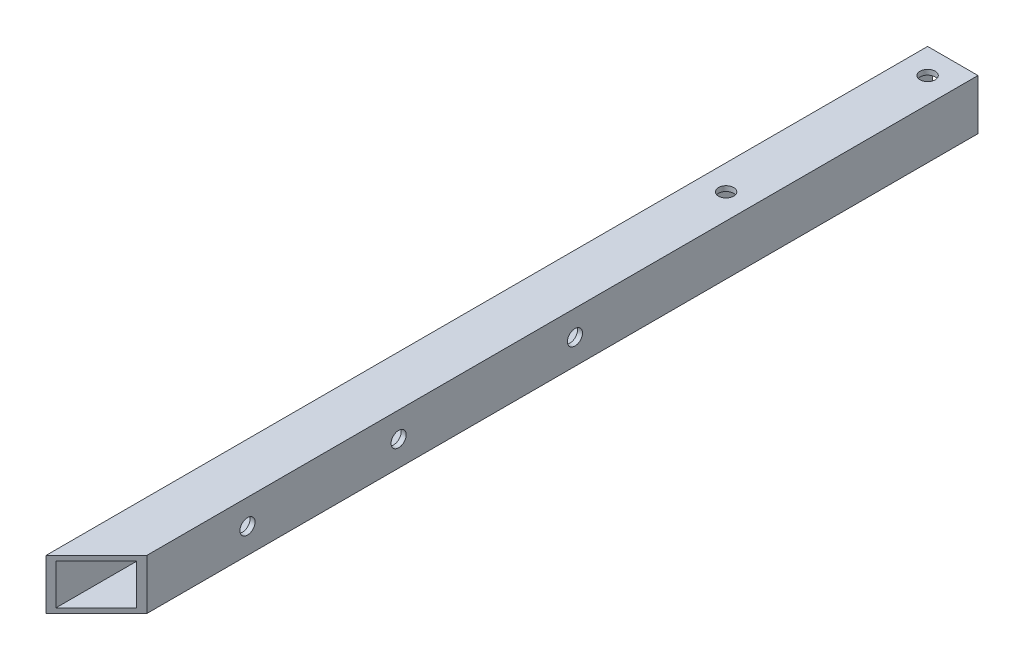
ISO-10303-21;
HEADER;
FILE_DESCRIPTION(('STEP AP214'),'2;1');
FILE_NAME('part.step','',(''),(''),'','','');
FILE_SCHEMA(('AUTOMOTIVE_DESIGN { 1 0 10303 214 1 1 1 1 }'));
ENDSEC;
DATA;
#1=APPLICATION_CONTEXT('core data for automotive mechanical design processes');
#2=APPLICATION_PROTOCOL_DEFINITION('international standard','automotive_design',2000,#1);
#3=PRODUCT_CONTEXT('',#1,'mechanical');
#4=PRODUCT('Part','Part','',(#3));
#5=PRODUCT_RELATED_PRODUCT_CATEGORY('part','',(#4));
#6=PRODUCT_DEFINITION_FORMATION('','',#4);
#7=PRODUCT_DEFINITION_CONTEXT('part definition',#1,'design');
#8=PRODUCT_DEFINITION('design','',#6,#7);
#9=PRODUCT_DEFINITION_SHAPE('','',#8);
#10=(LENGTH_UNIT() NAMED_UNIT(*) SI_UNIT(.MILLI.,.METRE.));
#11=(NAMED_UNIT(*) PLANE_ANGLE_UNIT() SI_UNIT($,.RADIAN.));
#12=(NAMED_UNIT(*) SI_UNIT($,.STERADIAN.) SOLID_ANGLE_UNIT());
#13=UNCERTAINTY_MEASURE_WITH_UNIT(LENGTH_MEASURE(1.E-05),#10,'distance_accuracy_value','');
#14=(GEOMETRIC_REPRESENTATION_CONTEXT(3) GLOBAL_UNCERTAINTY_ASSIGNED_CONTEXT((#13)) GLOBAL_UNIT_ASSIGNED_CONTEXT((#10,
#11,#12)) REPRESENTATION_CONTEXT('',''));
#15=CARTESIAN_POINT('',(0.,0.,0.));
#16=DIRECTION('',(0.,0.,1.));
#17=DIRECTION('',(1.,0.,0.));
#18=AXIS2_PLACEMENT_3D('',#15,#16,#17);
#19=CARTESIAN_POINT('',(0.,0.,0.));
#20=DIRECTION('',(0.,0.,1.));
#21=DIRECTION('',(1.,0.,0.));
#22=AXIS2_PLACEMENT_3D('',#19,#20,#21);
#23=PLANE('',#22);
#24=DIRECTION('',(0.,-1.,0.));
#25=VECTOR('',#24,1.);
#26=CARTESIAN_POINT('',(-5.,5.,0.));
#27=LINE('',#26,#25);
#28=CARTESIAN_POINT('',(-5.,5.,0.));
#29=VERTEX_POINT('',#28);
#30=CARTESIAN_POINT('',(-4.99999999999999,-5.,0.));
#31=VERTEX_POINT('',#30);
#32=EDGE_CURVE('E156',#29,#31,#27,.T.);
#33=ORIENTED_EDGE('',*,*,#32,.F.);
#34=DIRECTION('',(-1.,0.,0.));
#35=VECTOR('',#34,1.);
#36=CARTESIAN_POINT('',(-5.,5.,0.));
#37=LINE('',#36,#35);
#38=CARTESIAN_POINT('',(5.,5.,0.));
#39=VERTEX_POINT('',#38);
#40=EDGE_CURVE('E141',#39,#29,#37,.T.);
#41=ORIENTED_EDGE('',*,*,#40,.F.);
#42=DIRECTION('',(0.,1.,0.));
#43=VECTOR('',#42,1.);
#44=CARTESIAN_POINT('',(5.,5.,0.));
#45=LINE('',#44,#43);
#46=CARTESIAN_POINT('',(5.,-5.,0.));
#47=VERTEX_POINT('',#46);
#48=EDGE_CURVE('E150',#47,#39,#45,.T.);
#49=ORIENTED_EDGE('',*,*,#48,.F.);
#50=DIRECTION('',(1.,0.,0.));
#51=VECTOR('',#50,1.);
#52=CARTESIAN_POINT('',(-4.99999999999999,-5.,0.));
#53=LINE('',#52,#51);
#54=EDGE_CURVE('E158',#31,#47,#53,.T.);
#55=ORIENTED_EDGE('',*,*,#54,.F.);
#56=EDGE_LOOP('',(#33,#41,#49,#55));
#57=FACE_BOUND('',#56,.T.);
#58=DIRECTION('',(0.,-1.,0.));
#59=VECTOR('',#58,1.);
#60=CARTESIAN_POINT('',(-4.,5.00000000000001,0.));
#61=LINE('',#60,#59);
#62=CARTESIAN_POINT('',(-4.,4.,0.));
#63=VERTEX_POINT('',#62);
#64=CARTESIAN_POINT('',(-3.99999999999999,-4.,0.));
#65=VERTEX_POINT('',#64);
#66=EDGE_CURVE('E218',#63,#65,#61,.T.);
#67=ORIENTED_EDGE('',*,*,#66,.T.);
#68=DIRECTION('',(1.,0.,0.));
#69=VECTOR('',#68,1.);
#70=CARTESIAN_POINT('',(-4.99999999999999,-4.,0.));
#71=LINE('',#70,#69);
#72=CARTESIAN_POINT('',(4.,-4.,0.));
#73=VERTEX_POINT('',#72);
#74=EDGE_CURVE('E221',#65,#73,#71,.T.);
#75=ORIENTED_EDGE('',*,*,#74,.T.);
#76=DIRECTION('',(0.,1.,0.));
#77=VECTOR('',#76,1.);
#78=CARTESIAN_POINT('',(4.,5.,0.));
#79=LINE('',#78,#77);
#80=CARTESIAN_POINT('',(4.,4.,0.));
#81=VERTEX_POINT('',#80);
#82=EDGE_CURVE('E224',#73,#81,#79,.T.);
#83=ORIENTED_EDGE('',*,*,#82,.T.);
#84=DIRECTION('',(-1.,0.,0.));
#85=VECTOR('',#84,1.);
#86=CARTESIAN_POINT('',(-5.,4.,0.));
#87=LINE('',#86,#85);
#88=EDGE_CURVE('E227',#81,#63,#87,.T.);
#89=ORIENTED_EDGE('',*,*,#88,.T.);
#90=EDGE_LOOP('',(#67,#75,#83,#89));
#91=FACE_BOUND('',#90,.T.);
#92=ADVANCED_FACE('F63',(#57,#91),#23,.F.);
#93=CARTESIAN_POINT('',(-5.,5.,175.));
#94=DIRECTION('',(1.,0.,0.));
#95=DIRECTION('',(0.,1.,0.));
#96=AXIS2_PLACEMENT_3D('',#93,#94,#95);
#97=PLANE('',#96);
#98=CARTESIAN_POINT('',(-5.,0.,80.));
#99=DIRECTION('',(1.,0.,0.));
#100=DIRECTION('',(0.,0.,-1.));
#101=AXIS2_PLACEMENT_3D('',#98,#99,#100);
#102=CIRCLE('',#101,1.5);
#103=CARTESIAN_POINT('',(-5.,0.,78.5));
#104=VERTEX_POINT('',#103);
#105=EDGE_CURVE('E171',#104,#104,#102,.T.);
#106=ORIENTED_EDGE('',*,*,#105,.T.);
#107=EDGE_LOOP('',(#106));
#108=FACE_BOUND('',#107,.T.);
#109=CARTESIAN_POINT('',(-5.,0.,115.));
#110=DIRECTION('',(1.,0.,0.));
#111=DIRECTION('',(0.,0.,-1.));
#112=AXIS2_PLACEMENT_3D('',#109,#110,#111);
#113=CIRCLE('',#112,1.5);
#114=CARTESIAN_POINT('',(-5.,0.,113.5));
#115=VERTEX_POINT('',#114);
#116=EDGE_CURVE('E204',#115,#115,#113,.T.);
#117=ORIENTED_EDGE('',*,*,#116,.T.);
#118=EDGE_LOOP('',(#117));
#119=FACE_BOUND('',#118,.T.);
#120=CARTESIAN_POINT('',(-5.,0.,145.));
#121=DIRECTION('',(1.,0.,0.));
#122=DIRECTION('',(0.,0.,-1.));
#123=AXIS2_PLACEMENT_3D('',#120,#121,#122);
#124=CIRCLE('',#123,1.5);
#125=CARTESIAN_POINT('',(-5.,0.,143.5));
#126=VERTEX_POINT('',#125);
#127=EDGE_CURVE('E195',#126,#126,#124,.T.);
#128=ORIENTED_EDGE('',*,*,#127,.T.);
#129=EDGE_LOOP('',(#128));
#130=FACE_BOUND('',#129,.T.);
#131=ORIENTED_EDGE('',*,*,#32,.T.);
#132=DIRECTION('',(0.,0.,-1.));
#133=VECTOR('',#132,1.);
#134=CARTESIAN_POINT('',(-4.99999999999999,-5.,175.));
#135=LINE('',#134,#133);
#136=CARTESIAN_POINT('',(-5.,-5.,175.));
#137=VERTEX_POINT('',#136);
#138=EDGE_CURVE('E72',#137,#31,#135,.T.);
#139=ORIENTED_EDGE('',*,*,#138,.F.);
#140=DIRECTION('',(0.,-1.,0.));
#141=VECTOR('',#140,1.);
#142=CARTESIAN_POINT('',(-5.,5.,175.));
#143=LINE('',#142,#141);
#144=CARTESIAN_POINT('',(-5.,5.,175.));
#145=VERTEX_POINT('',#144);
#146=EDGE_CURVE('E130',#145,#137,#143,.T.);
#147=ORIENTED_EDGE('',*,*,#146,.F.);
#148=DIRECTION('',(0.,0.,-1.));
#149=VECTOR('',#148,1.);
#150=CARTESIAN_POINT('',(-5.,5.,175.));
#151=LINE('',#150,#149);
#152=EDGE_CURVE('E138',#145,#29,#151,.T.);
#153=ORIENTED_EDGE('',*,*,#152,.T.);
#154=EDGE_LOOP('',(#131,#139,#147,#153));
#155=FACE_BOUND('',#154,.T.);
#156=ADVANCED_FACE('F65',(#108,#119,#130,#155),#97,.F.);
#157=CARTESIAN_POINT('',(-4.99999999999999,-5.,175.));
#158=DIRECTION('',(0.,1.,0.));
#159=DIRECTION('',(0.,0.,1.));
#160=AXIS2_PLACEMENT_3D('',#157,#158,#159);
#161=PLANE('',#160);
#162=CARTESIAN_POINT('',(0.,-5.,5.));
#163=DIRECTION('',(0.,1.,0.));
#164=DIRECTION('',(0.,0.,1.));
#165=AXIS2_PLACEMENT_3D('',#162,#163,#164);
#166=CIRCLE('',#165,1.5);
#167=CARTESIAN_POINT('',(0.,-5.,6.5));
#168=VERTEX_POINT('',#167);
#169=EDGE_CURVE('E255',#168,#168,#166,.T.);
#170=ORIENTED_EDGE('',*,*,#169,.T.);
#171=EDGE_LOOP('',(#170));
#172=FACE_BOUND('',#171,.T.);
#173=CARTESIAN_POINT('',(0.,-5.,45.));
#174=DIRECTION('',(0.,1.,0.));
#175=DIRECTION('',(0.,0.,1.));
#176=AXIS2_PLACEMENT_3D('',#173,#174,#175);
#177=CIRCLE('',#176,1.5);
#178=CARTESIAN_POINT('',(0.,-5.,46.5));
#179=VERTEX_POINT('',#178);
#180=EDGE_CURVE('E134',#179,#179,#177,.T.);
#181=ORIENTED_EDGE('',*,*,#180,.T.);
#182=EDGE_LOOP('',(#181));
#183=FACE_BOUND('',#182,.T.);
#184=DIRECTION('',(0.,0.,-1.));
#185=VECTOR('',#184,1.);
#186=CARTESIAN_POINT('',(5.,-5.,175.));
#187=LINE('',#186,#185);
#188=CARTESIAN_POINT('',(5.,-5.,165.));
#189=VERTEX_POINT('',#188);
#190=EDGE_CURVE('E164',#189,#47,#187,.T.);
#191=ORIENTED_EDGE('',*,*,#190,.F.);
#192=DIRECTION('',(-0.707106781186547,0.,0.707106781186549));
#193=VECTOR('',#192,1.);
#194=CARTESIAN_POINT('',(-5.,-5.,175.));
#195=LINE('',#194,#193);
#196=EDGE_CURVE('E135',#189,#137,#195,.T.);
#197=ORIENTED_EDGE('',*,*,#196,.T.);
#198=ORIENTED_EDGE('',*,*,#138,.T.);
#199=ORIENTED_EDGE('',*,*,#54,.T.);
#200=EDGE_LOOP('',(#191,#197,#198,#199));
#201=FACE_BOUND('',#200,.T.);
#202=ADVANCED_FACE('F299',(#172,#183,#201),#161,.F.);
#203=CARTESIAN_POINT('',(5.,5.,175.));
#204=DIRECTION('',(-1.,0.,0.));
#205=DIRECTION('',(0.,0.,1.));
#206=AXIS2_PLACEMENT_3D('',#203,#204,#205);
#207=PLANE('',#206);
#208=CARTESIAN_POINT('',(5.,0.,80.));
#209=DIRECTION('',(1.,0.,0.));
#210=DIRECTION('',(0.,0.,-1.));
#211=AXIS2_PLACEMENT_3D('',#208,#209,#210);
#212=CIRCLE('',#211,1.5);
#213=CARTESIAN_POINT('',(5.,0.,78.5));
#214=VERTEX_POINT('',#213);
#215=EDGE_CURVE('E198',#214,#214,#212,.T.);
#216=ORIENTED_EDGE('',*,*,#215,.F.);
#217=EDGE_LOOP('',(#216));
#218=FACE_BOUND('',#217,.T.);
#219=CARTESIAN_POINT('',(5.,0.,115.));
#220=DIRECTION('',(1.,0.,0.));
#221=DIRECTION('',(0.,0.,-1.));
#222=AXIS2_PLACEMENT_3D('',#219,#220,#221);
#223=CIRCLE('',#222,1.5);
#224=CARTESIAN_POINT('',(5.,0.,113.5));
#225=VERTEX_POINT('',#224);
#226=EDGE_CURVE('E201',#225,#225,#223,.T.);
#227=ORIENTED_EDGE('',*,*,#226,.F.);
#228=EDGE_LOOP('',(#227));
#229=FACE_BOUND('',#228,.T.);
#230=CARTESIAN_POINT('',(5.,0.,145.));
#231=DIRECTION('',(1.,0.,0.));
#232=DIRECTION('',(0.,0.,-1.));
#233=AXIS2_PLACEMENT_3D('',#230,#231,#232);
#234=CIRCLE('',#233,1.5);
#235=CARTESIAN_POINT('',(5.,0.,143.5));
#236=VERTEX_POINT('',#235);
#237=EDGE_CURVE('E207',#236,#236,#234,.T.);
#238=ORIENTED_EDGE('',*,*,#237,.F.);
#239=EDGE_LOOP('',(#238));
#240=FACE_BOUND('',#239,.T.);
#241=DIRECTION('',(0.,0.,-1.));
#242=VECTOR('',#241,1.);
#243=CARTESIAN_POINT('',(5.,5.,175.));
#244=LINE('',#243,#242);
#245=CARTESIAN_POINT('',(5.,5.,165.));
#246=VERTEX_POINT('',#245);
#247=EDGE_CURVE('E145',#246,#39,#244,.T.);
#248=ORIENTED_EDGE('',*,*,#247,.F.);
#249=DIRECTION('',(0.,1.,0.));
#250=VECTOR('',#249,1.);
#251=CARTESIAN_POINT('',(5.,-5.,165.));
#252=LINE('',#251,#250);
#253=EDGE_CURVE('E80',#189,#246,#252,.T.);
#254=ORIENTED_EDGE('',*,*,#253,.F.);
#255=ORIENTED_EDGE('',*,*,#190,.T.);
#256=ORIENTED_EDGE('',*,*,#48,.T.);
#257=EDGE_LOOP('',(#248,#254,#255,#256));
#258=FACE_BOUND('',#257,.T.);
#259=ADVANCED_FACE('F274',(#218,#229,#240,#258),#207,.F.);
#260=CARTESIAN_POINT('',(-5.,5.,175.));
#261=DIRECTION('',(0.,-1.,0.));
#262=DIRECTION('',(0.,0.,-1.));
#263=AXIS2_PLACEMENT_3D('',#260,#261,#262);
#264=PLANE('',#263);
#265=CARTESIAN_POINT('',(0.,5.,5.));
#266=DIRECTION('',(0.,1.,0.));
#267=DIRECTION('',(0.,0.,1.));
#268=AXIS2_PLACEMENT_3D('',#265,#266,#267);
#269=CIRCLE('',#268,1.5);
#270=CARTESIAN_POINT('',(0.,5.,6.5));
#271=VERTEX_POINT('',#270);
#272=EDGE_CURVE('E257',#271,#271,#269,.T.);
#273=ORIENTED_EDGE('',*,*,#272,.F.);
#274=EDGE_LOOP('',(#273));
#275=FACE_BOUND('',#274,.T.);
#276=CARTESIAN_POINT('',(0.,5.,45.));
#277=DIRECTION('',(0.,1.,0.));
#278=DIRECTION('',(0.,0.,1.));
#279=AXIS2_PLACEMENT_3D('',#276,#277,#278);
#280=CIRCLE('',#279,1.5);
#281=CARTESIAN_POINT('',(0.,5.,46.5));
#282=VERTEX_POINT('',#281);
#283=EDGE_CURVE('E264',#282,#282,#280,.T.);
#284=ORIENTED_EDGE('',*,*,#283,.F.);
#285=EDGE_LOOP('',(#284));
#286=FACE_BOUND('',#285,.T.);
#287=ORIENTED_EDGE('',*,*,#152,.F.);
#288=DIRECTION('',(-0.707106781186547,0.,0.707106781186549));
#289=VECTOR('',#288,1.);
#290=CARTESIAN_POINT('',(-5.,5.,175.));
#291=LINE('',#290,#289);
#292=EDGE_CURVE('E126',#246,#145,#291,.T.);
#293=ORIENTED_EDGE('',*,*,#292,.F.);
#294=ORIENTED_EDGE('',*,*,#247,.T.);
#295=ORIENTED_EDGE('',*,*,#40,.T.);
#296=EDGE_LOOP('',(#287,#293,#294,#295));
#297=FACE_BOUND('',#296,.T.);
#298=ADVANCED_FACE('F139',(#275,#286,#297),#264,.F.);
#299=CARTESIAN_POINT('',(-4.,5.00000000000001,175.));
#300=DIRECTION('',(1.,0.,0.));
#301=DIRECTION('',(0.,1.,0.));
#302=AXIS2_PLACEMENT_3D('',#299,#300,#301);
#303=PLANE('',#302);
#304=DIRECTION('',(0.,1.,0.));
#305=VECTOR('',#304,1.);
#306=CARTESIAN_POINT('',(-4.,5.00000000000001,174.));
#307=LINE('',#306,#305);
#308=CARTESIAN_POINT('',(-3.99999999999999,-4.,174.));
#309=VERTEX_POINT('',#308);
#310=CARTESIAN_POINT('',(-4.,4.,174.));
#311=VERTEX_POINT('',#310);
#312=EDGE_CURVE('E87',#309,#311,#307,.T.);
#313=ORIENTED_EDGE('',*,*,#312,.F.);
#314=DIRECTION('',(0.,0.,-1.));
#315=VECTOR('',#314,1.);
#316=CARTESIAN_POINT('',(-3.99999999999999,-4.,175.));
#317=LINE('',#316,#315);
#318=EDGE_CURVE('E154',#309,#65,#317,.T.);
#319=ORIENTED_EDGE('',*,*,#318,.T.);
#320=ORIENTED_EDGE('',*,*,#66,.F.);
#321=DIRECTION('',(0.,0.,-1.));
#322=VECTOR('',#321,1.);
#323=CARTESIAN_POINT('',(-4.,4.,175.));
#324=LINE('',#323,#322);
#325=EDGE_CURVE('E230',#311,#63,#324,.T.);
#326=ORIENTED_EDGE('',*,*,#325,.F.);
#327=EDGE_LOOP('',(#313,#319,#320,#326));
#328=FACE_BOUND('',#327,.T.);
#329=CARTESIAN_POINT('',(-4.,0.,80.));
#330=DIRECTION('',(1.,0.,0.));
#331=DIRECTION('',(0.,1.,0.));
#332=AXIS2_PLACEMENT_3D('',#329,#330,#331);
#333=CIRCLE('',#332,1.5);
#334=CARTESIAN_POINT('',(-4.,1.49999999999999,80.));
#335=VERTEX_POINT('',#334);
#336=EDGE_CURVE('E178',#335,#335,#333,.T.);
#337=ORIENTED_EDGE('',*,*,#336,.F.);
#338=EDGE_LOOP('',(#337));
#339=FACE_BOUND('',#338,.T.);
#340=CARTESIAN_POINT('',(-4.,0.,115.));
#341=DIRECTION('',(1.,0.,0.));
#342=DIRECTION('',(0.,1.,0.));
#343=AXIS2_PLACEMENT_3D('',#340,#341,#342);
#344=CIRCLE('',#343,1.5);
#345=CARTESIAN_POINT('',(-4.,1.49999999999998,115.));
#346=VERTEX_POINT('',#345);
#347=EDGE_CURVE('E175',#346,#346,#344,.T.);
#348=ORIENTED_EDGE('',*,*,#347,.F.);
#349=EDGE_LOOP('',(#348));
#350=FACE_BOUND('',#349,.T.);
#351=CARTESIAN_POINT('',(-4.,0.,145.));
#352=DIRECTION('',(1.,0.,0.));
#353=DIRECTION('',(0.,1.,0.));
#354=AXIS2_PLACEMENT_3D('',#351,#352,#353);
#355=CIRCLE('',#354,1.5);
#356=CARTESIAN_POINT('',(-4.,1.49999999999998,145.));
#357=VERTEX_POINT('',#356);
#358=EDGE_CURVE('E170',#357,#357,#355,.T.);
#359=ORIENTED_EDGE('',*,*,#358,.F.);
#360=EDGE_LOOP('',(#359));
#361=FACE_BOUND('',#360,.T.);
#362=ADVANCED_FACE('F242',(#328,#339,#350,#361),#303,.T.);
#363=CARTESIAN_POINT('',(-4.99999999999999,-4.,175.));
#364=DIRECTION('',(0.,1.,0.));
#365=DIRECTION('',(0.,0.,1.));
#366=AXIS2_PLACEMENT_3D('',#363,#364,#365);
#367=PLANE('',#366);
#368=CARTESIAN_POINT('',(0.,-4.,5.));
#369=DIRECTION('',(0.,1.,0.));
#370=DIRECTION('',(0.,0.,1.));
#371=AXIS2_PLACEMENT_3D('',#368,#369,#370);
#372=CIRCLE('',#371,1.5);
#373=CARTESIAN_POINT('',(0.,-4.,6.5));
#374=VERTEX_POINT('',#373);
#375=EDGE_CURVE('E192',#374,#374,#372,.T.);
#376=ORIENTED_EDGE('',*,*,#375,.F.);
#377=EDGE_LOOP('',(#376));
#378=FACE_BOUND('',#377,.T.);
#379=CARTESIAN_POINT('',(0.,-4.,45.));
#380=DIRECTION('',(0.,1.,0.));
#381=DIRECTION('',(0.,0.,1.));
#382=AXIS2_PLACEMENT_3D('',#379,#380,#381);
#383=CIRCLE('',#382,1.5);
#384=CARTESIAN_POINT('',(0.,-4.,46.5));
#385=VERTEX_POINT('',#384);
#386=EDGE_CURVE('E181',#385,#385,#383,.T.);
#387=ORIENTED_EDGE('',*,*,#386,.F.);
#388=EDGE_LOOP('',(#387));
#389=FACE_BOUND('',#388,.T.);
#390=DIRECTION('',(-0.707106781186547,0.,0.707106781186549));
#391=VECTOR('',#390,1.);
#392=CARTESIAN_POINT('',(-5.,-4.,175.));
#393=LINE('',#392,#391);
#394=CARTESIAN_POINT('',(4.,-4.,166.));
#395=VERTEX_POINT('',#394);
#396=EDGE_CURVE('E186',#395,#309,#393,.T.);
#397=ORIENTED_EDGE('',*,*,#396,.F.);
#398=DIRECTION('',(0.,0.,-1.));
#399=VECTOR('',#398,1.);
#400=CARTESIAN_POINT('',(4.,-4.,175.));
#401=LINE('',#400,#399);
#402=EDGE_CURVE('E233',#395,#73,#401,.T.);
#403=ORIENTED_EDGE('',*,*,#402,.T.);
#404=ORIENTED_EDGE('',*,*,#74,.F.);
#405=ORIENTED_EDGE('',*,*,#318,.F.);
#406=EDGE_LOOP('',(#397,#403,#404,#405));
#407=FACE_BOUND('',#406,.T.);
#408=ADVANCED_FACE('F245',(#378,#389,#407),#367,.T.);
#409=CARTESIAN_POINT('',(4.,5.,175.));
#410=DIRECTION('',(-1.,0.,0.));
#411=DIRECTION('',(0.,0.,1.));
#412=AXIS2_PLACEMENT_3D('',#409,#410,#411);
#413=PLANE('',#412);
#414=DIRECTION('',(0.,-1.,0.));
#415=VECTOR('',#414,1.);
#416=CARTESIAN_POINT('',(4.,5.,166.));
#417=LINE('',#416,#415);
#418=CARTESIAN_POINT('',(4.00000000000001,4.,166.));
#419=VERTEX_POINT('',#418);
#420=EDGE_CURVE('E188',#419,#395,#417,.T.);
#421=ORIENTED_EDGE('',*,*,#420,.F.);
#422=DIRECTION('',(0.,0.,-1.));
#423=VECTOR('',#422,1.);
#424=CARTESIAN_POINT('',(4.,4.,175.));
#425=LINE('',#424,#423);
#426=EDGE_CURVE('E232',#419,#81,#425,.T.);
#427=ORIENTED_EDGE('',*,*,#426,.T.);
#428=ORIENTED_EDGE('',*,*,#82,.F.);
#429=ORIENTED_EDGE('',*,*,#402,.F.);
#430=EDGE_LOOP('',(#421,#427,#428,#429));
#431=FACE_BOUND('',#430,.T.);
#432=CARTESIAN_POINT('',(4.,0.,80.));
#433=DIRECTION('',(-1.,0.,0.));
#434=DIRECTION('',(0.,0.,1.));
#435=AXIS2_PLACEMENT_3D('',#432,#433,#434);
#436=CIRCLE('',#435,1.5);
#437=CARTESIAN_POINT('',(4.,0.,81.5));
#438=VERTEX_POINT('',#437);
#439=EDGE_CURVE('E176',#438,#438,#436,.T.);
#440=ORIENTED_EDGE('',*,*,#439,.F.);
#441=EDGE_LOOP('',(#440));
#442=FACE_BOUND('',#441,.T.);
#443=CARTESIAN_POINT('',(4.,0.,115.));
#444=DIRECTION('',(-1.,0.,0.));
#445=DIRECTION('',(0.,0.,1.));
#446=AXIS2_PLACEMENT_3D('',#443,#444,#445);
#447=CIRCLE('',#446,1.5);
#448=CARTESIAN_POINT('',(4.,0.,116.5));
#449=VERTEX_POINT('',#448);
#450=EDGE_CURVE('E172',#449,#449,#447,.T.);
#451=ORIENTED_EDGE('',*,*,#450,.F.);
#452=EDGE_LOOP('',(#451));
#453=FACE_BOUND('',#452,.T.);
#454=CARTESIAN_POINT('',(4.,0.,145.));
#455=DIRECTION('',(-1.,0.,0.));
#456=DIRECTION('',(0.,0.,1.));
#457=AXIS2_PLACEMENT_3D('',#454,#455,#456);
#458=CIRCLE('',#457,1.5);
#459=CARTESIAN_POINT('',(4.,0.,146.5));
#460=VERTEX_POINT('',#459);
#461=EDGE_CURVE('E167',#460,#460,#458,.T.);
#462=ORIENTED_EDGE('',*,*,#461,.F.);
#463=EDGE_LOOP('',(#462));
#464=FACE_BOUND('',#463,.T.);
#465=ADVANCED_FACE('F253',(#431,#442,#453,#464),#413,.T.);
#466=CARTESIAN_POINT('',(-5.,4.,175.));
#467=DIRECTION('',(0.,-1.,0.));
#468=DIRECTION('',(0.,0.,-1.));
#469=AXIS2_PLACEMENT_3D('',#466,#467,#468);
#470=PLANE('',#469);
#471=CARTESIAN_POINT('',(0.,4.00000000000001,5.));
#472=DIRECTION('',(0.,-1.,0.));
#473=DIRECTION('',(0.,0.,-1.));
#474=AXIS2_PLACEMENT_3D('',#471,#472,#473);
#475=CIRCLE('',#474,1.5);
#476=CARTESIAN_POINT('',(0.,4.00000000000001,3.5));
#477=VERTEX_POINT('',#476);
#478=EDGE_CURVE('E67',#477,#477,#475,.T.);
#479=ORIENTED_EDGE('',*,*,#478,.F.);
#480=EDGE_LOOP('',(#479));
#481=FACE_BOUND('',#480,.T.);
#482=CARTESIAN_POINT('',(0.,4.00000000000001,45.));
#483=DIRECTION('',(0.,-1.,0.));
#484=DIRECTION('',(0.,0.,-1.));
#485=AXIS2_PLACEMENT_3D('',#482,#483,#484);
#486=CIRCLE('',#485,1.5);
#487=CARTESIAN_POINT('',(0.,4.00000000000001,43.5));
#488=VERTEX_POINT('',#487);
#489=EDGE_CURVE('E179',#488,#488,#486,.T.);
#490=ORIENTED_EDGE('',*,*,#489,.F.);
#491=EDGE_LOOP('',(#490));
#492=FACE_BOUND('',#491,.T.);
#493=DIRECTION('',(0.707106781186547,0.,-0.707106781186549));
#494=VECTOR('',#493,1.);
#495=CARTESIAN_POINT('',(-5.,4.,175.));
#496=LINE('',#495,#494);
#497=EDGE_CURVE('E12',#311,#419,#496,.T.);
#498=ORIENTED_EDGE('',*,*,#497,.F.);
#499=ORIENTED_EDGE('',*,*,#325,.T.);
#500=ORIENTED_EDGE('',*,*,#88,.F.);
#501=ORIENTED_EDGE('',*,*,#426,.F.);
#502=EDGE_LOOP('',(#498,#499,#500,#501));
#503=FACE_BOUND('',#502,.T.);
#504=ADVANCED_FACE('F250',(#481,#492,#503),#470,.T.);
#505=CARTESIAN_POINT('',(-5.,0.,145.));
#506=DIRECTION('',(1.,0.,0.));
#507=DIRECTION('',(0.,0.,-1.));
#508=AXIS2_PLACEMENT_3D('',#505,#506,#507);
#509=CYLINDRICAL_SURFACE('',#508,1.5);
#510=ORIENTED_EDGE('',*,*,#461,.T.);
#511=EDGE_LOOP('',(#510));
#512=FACE_BOUND('',#511,.T.);
#513=ORIENTED_EDGE('',*,*,#237,.T.);
#514=EDGE_LOOP('',(#513));
#515=FACE_BOUND('',#514,.T.);
#516=ADVANCED_FACE('F336',(#512,#515),#509,.F.);
#517=CARTESIAN_POINT('',(-5.,0.,115.));
#518=DIRECTION('',(1.,0.,0.));
#519=DIRECTION('',(0.,0.,-1.));
#520=AXIS2_PLACEMENT_3D('',#517,#518,#519);
#521=CYLINDRICAL_SURFACE('',#520,1.5);
#522=ORIENTED_EDGE('',*,*,#450,.T.);
#523=EDGE_LOOP('',(#522));
#524=FACE_BOUND('',#523,.T.);
#525=ORIENTED_EDGE('',*,*,#226,.T.);
#526=EDGE_LOOP('',(#525));
#527=FACE_BOUND('',#526,.T.);
#528=ADVANCED_FACE('F340',(#524,#527),#521,.F.);
#529=CARTESIAN_POINT('',(-5.,0.,80.));
#530=DIRECTION('',(1.,0.,0.));
#531=DIRECTION('',(0.,0.,-1.));
#532=AXIS2_PLACEMENT_3D('',#529,#530,#531);
#533=CYLINDRICAL_SURFACE('',#532,1.5);
#534=ORIENTED_EDGE('',*,*,#439,.T.);
#535=EDGE_LOOP('',(#534));
#536=FACE_BOUND('',#535,.T.);
#537=ORIENTED_EDGE('',*,*,#215,.T.);
#538=EDGE_LOOP('',(#537));
#539=FACE_BOUND('',#538,.T.);
#540=ADVANCED_FACE('F345',(#536,#539),#533,.F.);
#541=ORIENTED_EDGE('',*,*,#358,.T.);
#542=EDGE_LOOP('',(#541));
#543=FACE_BOUND('',#542,.T.);
#544=ORIENTED_EDGE('',*,*,#127,.F.);
#545=EDGE_LOOP('',(#544));
#546=FACE_BOUND('',#545,.T.);
#547=ADVANCED_FACE('F342',(#543,#546),#509,.F.);
#548=ORIENTED_EDGE('',*,*,#347,.T.);
#549=EDGE_LOOP('',(#548));
#550=FACE_BOUND('',#549,.T.);
#551=ORIENTED_EDGE('',*,*,#116,.F.);
#552=EDGE_LOOP('',(#551));
#553=FACE_BOUND('',#552,.T.);
#554=ADVANCED_FACE('F347',(#550,#553),#521,.F.);
#555=ORIENTED_EDGE('',*,*,#336,.T.);
#556=EDGE_LOOP('',(#555));
#557=FACE_BOUND('',#556,.T.);
#558=ORIENTED_EDGE('',*,*,#105,.F.);
#559=EDGE_LOOP('',(#558));
#560=FACE_BOUND('',#559,.T.);
#561=ADVANCED_FACE('F289',(#557,#560),#533,.F.);
#562=CARTESIAN_POINT('',(-5.,-5.,175.));
#563=DIRECTION('',(-0.707106781186549,0.,-0.707106781186547));
#564=DIRECTION('',(-0.707106781186547,0.,0.707106781186549));
#565=AXIS2_PLACEMENT_3D('',#562,#563,#564);
#566=PLANE('',#565);
#567=ORIENTED_EDGE('',*,*,#312,.T.);
#568=ORIENTED_EDGE('',*,*,#497,.T.);
#569=ORIENTED_EDGE('',*,*,#420,.T.);
#570=ORIENTED_EDGE('',*,*,#396,.T.);
#571=EDGE_LOOP('',(#567,#568,#569,#570));
#572=FACE_BOUND('',#571,.T.);
#573=ORIENTED_EDGE('',*,*,#292,.T.);
#574=ORIENTED_EDGE('',*,*,#146,.T.);
#575=ORIENTED_EDGE('',*,*,#196,.F.);
#576=ORIENTED_EDGE('',*,*,#253,.T.);
#577=EDGE_LOOP('',(#573,#574,#575,#576));
#578=FACE_BOUND('',#577,.T.);
#579=ADVANCED_FACE('F128',(#572,#578),#566,.F.);
#580=CARTESIAN_POINT('',(0.,-5.,45.));
#581=DIRECTION('',(0.,1.,0.));
#582=DIRECTION('',(0.,0.,1.));
#583=AXIS2_PLACEMENT_3D('',#580,#581,#582);
#584=CYLINDRICAL_SURFACE('',#583,1.5);
#585=ORIENTED_EDGE('',*,*,#489,.T.);
#586=EDGE_LOOP('',(#585));
#587=FACE_BOUND('',#586,.T.);
#588=ORIENTED_EDGE('',*,*,#283,.T.);
#589=EDGE_LOOP('',(#588));
#590=FACE_BOUND('',#589,.T.);
#591=ADVANCED_FACE('F278',(#587,#590),#584,.F.);
#592=CARTESIAN_POINT('',(0.,-5.,5.));
#593=DIRECTION('',(0.,1.,0.));
#594=DIRECTION('',(0.,0.,1.));
#595=AXIS2_PLACEMENT_3D('',#592,#593,#594);
#596=CYLINDRICAL_SURFACE('',#595,1.5);
#597=ORIENTED_EDGE('',*,*,#478,.T.);
#598=EDGE_LOOP('',(#597));
#599=FACE_BOUND('',#598,.T.);
#600=ORIENTED_EDGE('',*,*,#272,.T.);
#601=EDGE_LOOP('',(#600));
#602=FACE_BOUND('',#601,.T.);
#603=ADVANCED_FACE('F270',(#599,#602),#596,.F.);
#604=ORIENTED_EDGE('',*,*,#386,.T.);
#605=EDGE_LOOP('',(#604));
#606=FACE_BOUND('',#605,.T.);
#607=ORIENTED_EDGE('',*,*,#180,.F.);
#608=EDGE_LOOP('',(#607));
#609=FACE_BOUND('',#608,.T.);
#610=ADVANCED_FACE('F281',(#606,#609),#584,.F.);
#611=ORIENTED_EDGE('',*,*,#375,.T.);
#612=EDGE_LOOP('',(#611));
#613=FACE_BOUND('',#612,.T.);
#614=ORIENTED_EDGE('',*,*,#169,.F.);
#615=EDGE_LOOP('',(#614));
#616=FACE_BOUND('',#615,.T.);
#617=ADVANCED_FACE('F288',(#613,#616),#596,.F.);
#618=CLOSED_SHELL('',(#92,#156,#202,#259,#298,#362,#408,#465,#504,#516,#528,#540,#547,#554,#561,
#579,#591,#603,#610,#617));
#619=MANIFOLD_SOLID_BREP('B2',#618);
#620=ADVANCED_BREP_SHAPE_REPRESENTATION('',(#18,#619),#14);
#621=SHAPE_DEFINITION_REPRESENTATION(#9,#620);
ENDSEC;
END-ISO-10303-21;
